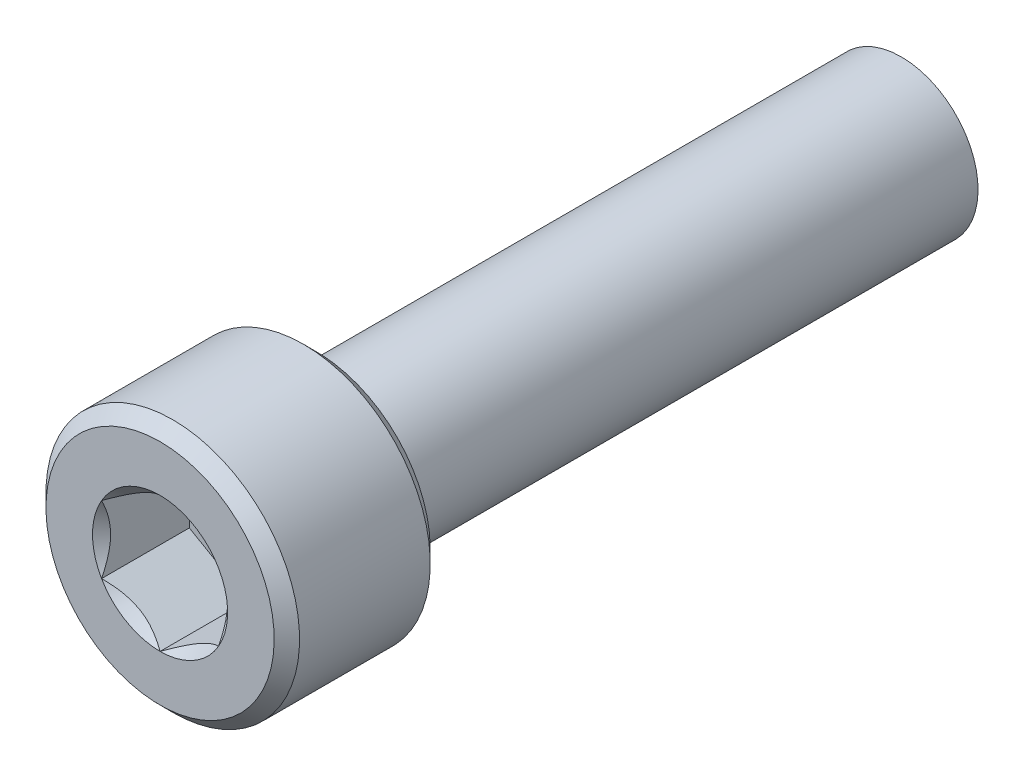
ISO-10303-21;
HEADER;
FILE_DESCRIPTION(('STEP AP214'),'2;1');
FILE_NAME('part.step','',(''),(''),'','','');
FILE_SCHEMA(('AUTOMOTIVE_DESIGN { 1 0 10303 214 1 1 1 1 }'));
ENDSEC;
DATA;
#1=APPLICATION_CONTEXT('core data for automotive mechanical design processes');
#2=APPLICATION_PROTOCOL_DEFINITION('international standard','automotive_design',2000,#1);
#3=PRODUCT_CONTEXT('',#1,'mechanical');
#4=PRODUCT('Part','Part','',(#3));
#5=PRODUCT_RELATED_PRODUCT_CATEGORY('part','',(#4));
#6=PRODUCT_DEFINITION_FORMATION('','',#4);
#7=PRODUCT_DEFINITION_CONTEXT('part definition',#1,'design');
#8=PRODUCT_DEFINITION('design','',#6,#7);
#9=PRODUCT_DEFINITION_SHAPE('','',#8);
#10=(LENGTH_UNIT() NAMED_UNIT(*) SI_UNIT(.MILLI.,.METRE.));
#11=(NAMED_UNIT(*) PLANE_ANGLE_UNIT() SI_UNIT($,.RADIAN.));
#12=(NAMED_UNIT(*) SI_UNIT($,.STERADIAN.) SOLID_ANGLE_UNIT());
#13=UNCERTAINTY_MEASURE_WITH_UNIT(LENGTH_MEASURE(1.E-05),#10,'distance_accuracy_value','');
#14=(GEOMETRIC_REPRESENTATION_CONTEXT(3) GLOBAL_UNCERTAINTY_ASSIGNED_CONTEXT((#13)) GLOBAL_UNIT_ASSIGNED_CONTEXT((#10,
#11,#12)) REPRESENTATION_CONTEXT('',''));
#15=CARTESIAN_POINT('',(0.,0.,0.));
#16=DIRECTION('',(0.,0.,1.));
#17=DIRECTION('',(1.,0.,0.));
#18=AXIS2_PLACEMENT_3D('',#15,#16,#17);
#19=CARTESIAN_POINT('',(3.,-5.19615242270663,3.5));
#20=DIRECTION('',(0.,0.,1.));
#21=DIRECTION('',(0.,-1.,0.));
#22=AXIS2_PLACEMENT_3D('',#19,#20,#21);
#23=PLANE('',#22);
#24=DIRECTION('',(-0.866025403784439,-0.5,0.));
#25=VECTOR('',#24,1.);
#26=CARTESIAN_POINT('',(0.,3.46410161513776,3.5));
#27=LINE('',#26,#25);
#28=CARTESIAN_POINT('',(0.,3.46410161513776,3.5));
#29=VERTEX_POINT('',#28);
#30=CARTESIAN_POINT('',(-3.,1.73205080756888,3.5));
#31=VERTEX_POINT('',#30);
#32=EDGE_CURVE('E82',#29,#31,#27,.T.);
#33=ORIENTED_EDGE('',*,*,#32,.T.);
#34=DIRECTION('',(0.,-1.,0.));
#35=VECTOR('',#34,1.);
#36=CARTESIAN_POINT('',(-3.,1.73205080756888,3.5));
#37=LINE('',#36,#35);
#38=CARTESIAN_POINT('',(-3.,-1.73205080756888,3.5));
#39=VERTEX_POINT('',#38);
#40=EDGE_CURVE('E84',#31,#39,#37,.T.);
#41=ORIENTED_EDGE('',*,*,#40,.T.);
#42=DIRECTION('',(0.866025403784439,-0.5,0.));
#43=VECTOR('',#42,1.);
#44=CARTESIAN_POINT('',(-3.,-1.73205080756888,3.5));
#45=LINE('',#44,#43);
#46=CARTESIAN_POINT('',(0.,-3.46410161513776,3.5));
#47=VERTEX_POINT('',#46);
#48=EDGE_CURVE('E85',#39,#47,#45,.T.);
#49=ORIENTED_EDGE('',*,*,#48,.T.);
#50=DIRECTION('',(0.866025403784439,0.5,0.));
#51=VECTOR('',#50,1.);
#52=CARTESIAN_POINT('',(0.,-3.46410161513776,3.5));
#53=LINE('',#52,#51);
#54=CARTESIAN_POINT('',(3.,-1.73205080756888,3.5));
#55=VERTEX_POINT('',#54);
#56=EDGE_CURVE('E71',#47,#55,#53,.T.);
#57=ORIENTED_EDGE('',*,*,#56,.T.);
#58=DIRECTION('',(0.,1.,0.));
#59=VECTOR('',#58,1.);
#60=CARTESIAN_POINT('',(3.,-1.73205080756888,3.5));
#61=LINE('',#60,#59);
#62=CARTESIAN_POINT('',(3.,1.73205080756888,3.5));
#63=VERTEX_POINT('',#62);
#64=EDGE_CURVE('E110',#55,#63,#61,.T.);
#65=ORIENTED_EDGE('',*,*,#64,.T.);
#66=DIRECTION('',(-0.866025403784439,0.5,0.));
#67=VECTOR('',#66,1.);
#68=CARTESIAN_POINT('',(3.,1.73205080756888,3.5));
#69=LINE('',#68,#67);
#70=EDGE_CURVE('E115',#63,#29,#69,.T.);
#71=ORIENTED_EDGE('',*,*,#70,.T.);
#72=EDGE_LOOP('',(#33,#41,#49,#57,#65,#71));
#73=FACE_BOUND('',#72,.T.);
#74=ADVANCED_FACE('F16',(#73),#23,.T.);
#75=CARTESIAN_POINT('',(-3.,-1.73205080756888,3.5));
#76=DIRECTION('',(-0.5,-0.866025403784439,0.));
#77=DIRECTION('',(0.866025403784439,-0.5,0.));
#78=AXIS2_PLACEMENT_3D('',#75,#76,#77);
#79=PLANE('',#78);
#80=CARTESIAN_POINT('',(-2.99999999999032,-1.7320508075832,8.00000000004136));
#81=CARTESIAN_POINT('',(-2.89688854158698,-1.79158223584331,7.9405256964109));
#82=CARTESIAN_POINT('',(-2.79205304728486,-1.85210903669697,7.88454499927976));
#83=CARTESIAN_POINT('',(-2.57828271602221,-1.97552939499453,7.78204673290586));
#84=CARTESIAN_POINT('',(-2.46932756060096,-2.03843468330721,7.73558617503093));
#85=CARTESIAN_POINT('',(-2.24962485444419,-2.16528009984896,7.65599891925579));
#86=CARTESIAN_POINT('',(-2.13893322488729,-2.2291879419705,7.62267223591901));
#87=CARTESIAN_POINT('',(-1.91511368639457,-2.35841021276905,7.57132616074406));
#88=CARTESIAN_POINT('',(-1.80199261010754,-2.42372069661444,7.55326845527869));
#89=CARTESIAN_POINT('',(-1.60702348021882,-2.53628617623938,7.53697523665388));
#90=CARTESIAN_POINT('',(-1.52542705975241,-2.58339589156056,7.53456399619299));
#91=CARTESIAN_POINT('',(-1.36236704805204,-2.67753863320983,7.53863151806395));
#92=CARTESIAN_POINT('',(-1.28090351339421,-2.72457162687367,7.545113396421));
#93=CARTESIAN_POINT('',(-1.11874833460044,-2.81819196300075,7.56659704587872));
#94=CARTESIAN_POINT('',(-1.03805765621663,-2.86477874788674,7.58160834263353));
#95=CARTESIAN_POINT('',(-0.878062170848356,-2.95715218443323,7.61933151354671));
#96=CARTESIAN_POINT('',(-0.798757258069119,-3.00293889717438,7.64204279713312));
#97=CARTESIAN_POINT('',(-0.657986748130276,-3.08421278898154,7.68876371422157));
#98=CARTESIAN_POINT('',(-0.596209197436678,-3.11988007450436,7.71154386359159));
#99=CARTESIAN_POINT('',(-0.473762853058809,-3.19057450439221,7.76077453974336));
#100=CARTESIAN_POINT('',(-0.413094092865233,-3.22560162942137,7.78722517718446));
#101=CARTESIAN_POINT('',(-0.293056496944738,-3.29490536773894,7.84320408348193));
#102=CARTESIAN_POINT('',(-0.233684247446644,-3.32918395196906,7.87272267287432));
#103=CARTESIAN_POINT('',(-0.116038978212991,-3.39710647983,7.93445005433357));
#104=CARTESIAN_POINT('',(-0.0577653112790005,-3.430750797121,7.96665719768312));
#105=CARTESIAN_POINT('',(-1.43648357031693E-11,-3.46410161512946,8.00000000004499));
#106=B_SPLINE_CURVE_WITH_KNOTS('',3,(#80,#81,#82,#83,#84,#85,#86,#87,#88,#89,#90,#91,#92,#93,
#94,#95,#96,#97,#98,#99,#100,#101,#102,#103,#104,#105),.UNSPECIFIED.,.F.,.F.,(4,2,2,2,2,2,2,2,2,
2,2,2,4),(0.,0.399548839738843,0.801424624392494,1.19691998043515,1.59141997109659,
1.87377108833457,2.15622116274835,2.43898729914404,2.7217317529063,2.94627735487685,
3.17082972801043,3.39469398393905,3.61842195284949),.UNSPECIFIED.);
#107=CARTESIAN_POINT('',(-2.99999999999255,-1.73205080756458,8.00000000004468));
#108=VERTEX_POINT('',#107);
#109=CARTESIAN_POINT('',(5.61843602158199E-12,-3.46410161512591,8.00000000004144));
#110=VERTEX_POINT('',#109);
#111=EDGE_CURVE('E19',#108,#110,#106,.T.);
#112=ORIENTED_EDGE('',*,*,#111,.T.);
#113=DIRECTION('',(0.,0.,1.));
#114=VECTOR('',#113,1.);
#115=CARTESIAN_POINT('',(0.,-3.46410161513776,3.5));
#116=LINE('',#115,#114);
#117=EDGE_CURVE('E90',#110,#47,#116,.F.);
#118=ORIENTED_EDGE('',*,*,#117,.T.);
#119=ORIENTED_EDGE('',*,*,#48,.F.);
#120=DIRECTION('',(0.,0.,1.));
#121=VECTOR('',#120,1.);
#122=CARTESIAN_POINT('',(-3.,-1.73205080756888,3.5));
#123=LINE('',#122,#121);
#124=EDGE_CURVE('E58',#39,#108,#123,.T.);
#125=ORIENTED_EDGE('',*,*,#124,.T.);
#126=EDGE_LOOP('',(#112,#118,#119,#125));
#127=FACE_BOUND('',#126,.T.);
#128=ADVANCED_FACE('F89',(#127),#79,.F.);
#129=CARTESIAN_POINT('',(-3.,1.73205080756888,3.5));
#130=DIRECTION('',(-1.,0.,0.));
#131=DIRECTION('',(0.,-1.,0.));
#132=AXIS2_PLACEMENT_3D('',#129,#130,#131);
#133=PLANE('',#132);
#134=CARTESIAN_POINT('',(-3.00000000000756,1.73205080755334,8.00000000004136));
#135=CARTESIAN_POINT('',(-3.00000000000272,1.61298795102473,7.9405256964109));
#136=CARTESIAN_POINT('',(-3.00000000000073,1.49193434931396,7.88454499927976));
#137=CARTESIAN_POINT('',(-2.99999999999927,1.24509363271631,7.78204673290586));
#138=CARTESIAN_POINT('',(-2.99999999999981,1.11928305609189,7.73558617503093));
#139=CARTESIAN_POINT('',(-3.00000000000019,0.86559222300906,7.65599891925579));
#140=CARTESIAN_POINT('',(-3.00000000000005,0.737776538765718,7.62267223591901));
#141=CARTESIAN_POINT('',(-2.99999999999995,0.479331997168439,7.57132616074405));
#142=CARTESIAN_POINT('',(-2.99999999999999,0.348711029477738,7.55326845527868));
#143=CARTESIAN_POINT('',(-3.00000000000001,0.123580070227885,7.53697523665387));
#144=CARTESIAN_POINT('',(-3.,0.0293606395855113,7.53456399619298));
#145=CARTESIAN_POINT('',(-3.,-0.158924843713037,7.53863151806394));
#146=CARTESIAN_POINT('',(-3.,-0.252990831040703,7.54511339642099));
#147=CARTESIAN_POINT('',(-3.,-0.440231503294856,7.56659704587872));
#148=CARTESIAN_POINT('',(-3.,-0.533405073066836,7.58160834263352));
#149=CARTESIAN_POINT('',(-3.,-0.718151946159826,7.61933151354671));
#150=CARTESIAN_POINT('',(-3.,-0.809725371642131,7.64204279713312));
#151=CARTESIAN_POINT('',(-3.,-0.972273155256436,7.68876371422157));
#152=CARTESIAN_POINT('',(-3.,-1.04360772630208,7.71154386359159));
#153=CARTESIAN_POINT('',(-3.,-1.18499658607778,7.76077453974336));
#154=CARTESIAN_POINT('',(-3.,-1.25505083613611,7.78722517718446));
#155=CARTESIAN_POINT('',(-3.,-1.39365831277125,7.84320408348193));
#156=CARTESIAN_POINT('',(-3.,-1.46221548123149,7.87272267287432));
#157=CARTESIAN_POINT('',(-3.,-1.59806053695336,7.93445005433357));
#158=CARTESIAN_POINT('',(-3.,-1.66534917153537,7.96665719768312));
#159=CARTESIAN_POINT('',(-3.,-1.73205080755229,8.00000000004499));
#160=B_SPLINE_CURVE_WITH_KNOTS('',3,(#134,#135,#136,#137,#138,#139,#140,#141,#142,#143,#144,
#145,#146,#147,#148,#149,#150,#151,#152,#153,#154,#155,#156,#157,#158,#159),.UNSPECIFIED.,.F.,
.F.,(4,2,2,2,2,2,2,2,2,2,2,2,4),(0.,0.399548839738845,0.801424624392497,1.19691998043516,
1.59141997109659,1.87377108833457,2.15622116274836,2.43898729914404,2.7217317529063,
2.94627735487685,3.17082972801044,3.39469398393906,3.6184219528495),.UNSPECIFIED.);
#161=CARTESIAN_POINT('',(-2.99999999999255,1.73205080756458,8.00000000004468));
#162=VERTEX_POINT('',#161);
#163=EDGE_CURVE('E94',#162,#108,#160,.T.);
#164=ORIENTED_EDGE('',*,*,#163,.T.);
#165=ORIENTED_EDGE('',*,*,#124,.F.);
#166=ORIENTED_EDGE('',*,*,#40,.F.);
#167=DIRECTION('',(0.,0.,1.));
#168=VECTOR('',#167,1.);
#169=CARTESIAN_POINT('',(-3.,1.73205080756888,3.5));
#170=LINE('',#169,#168);
#171=EDGE_CURVE('E96',#31,#162,#170,.T.);
#172=ORIENTED_EDGE('',*,*,#171,.T.);
#173=EDGE_LOOP('',(#164,#165,#166,#172));
#174=FACE_BOUND('',#173,.T.);
#175=ADVANCED_FACE('F92',(#174),#133,.F.);
#176=CARTESIAN_POINT('',(0.,3.46410161513776,3.5));
#177=DIRECTION('',(-0.5,0.866025403784439,0.));
#178=DIRECTION('',(-0.866025403784439,-0.5,0.));
#179=AXIS2_PLACEMENT_3D('',#176,#177,#178);
#180=PLANE('',#179);
#181=CARTESIAN_POINT('',(-1.72454109732172E-11,3.46410161513654,8.00000000004137));
#182=CARTESIAN_POINT('',(-0.103111458415738,3.40457018686804,7.9405256964109));
#183=CARTESIAN_POINT('',(-0.207946952715874,3.34404338601093,7.88454499927977));
#184=CARTESIAN_POINT('',(-0.42171728397706,3.22062302771084,7.78204673290587));
#185=CARTESIAN_POINT('',(-0.53067243939885,3.15771773939909,7.73558617503093));
#186=CARTESIAN_POINT('',(-0.750375145556008,3.03087232285802,7.6559989192558));
#187=CARTESIAN_POINT('',(-0.861066775112762,2.96696448073622,7.62267223591901));
#188=CARTESIAN_POINT('',(-1.08488631360538,2.8377422099375,7.57132616074406));
#189=CARTESIAN_POINT('',(-1.19800738989245,2.77243172609218,7.55326845527869));
#190=CARTESIAN_POINT('',(-1.39297651978119,2.65986624646727,7.53697523665388));
#191=CARTESIAN_POINT('',(-1.47457294024759,2.61275653114608,7.53456399619299));
#192=CARTESIAN_POINT('',(-1.63763295194796,2.5186137894968,7.53863151806395));
#193=CARTESIAN_POINT('',(-1.71909648660579,2.47158079583297,7.545113396421));
#194=CARTESIAN_POINT('',(-1.88125166539956,2.37796045970589,7.56659704587872));
#195=CARTESIAN_POINT('',(-1.96194234378338,2.3313736748199,7.58160834263353));
#196=CARTESIAN_POINT('',(-2.12193782915165,2.23900023827341,7.61933151354671));
#197=CARTESIAN_POINT('',(-2.20124274193088,2.19321352553226,7.64204279713312));
#198=CARTESIAN_POINT('',(-2.34201325186973,2.1119396337251,7.68876371422157));
#199=CARTESIAN_POINT('',(-2.40379080256332,2.07627234820228,7.7115438635916));
#200=CARTESIAN_POINT('',(-2.52623714694119,2.00557791831443,7.76077453974336));
#201=CARTESIAN_POINT('',(-2.58690590713477,1.97055079328527,7.78722517718446));
#202=CARTESIAN_POINT('',(-2.70694350305526,1.9012470549677,7.84320408348194));
#203=CARTESIAN_POINT('',(-2.76631575255336,1.86696847073758,7.87272267287432));
#204=CARTESIAN_POINT('',(-2.88396102178701,1.79904594287664,7.93445005433357));
#205=CARTESIAN_POINT('',(-2.942234688721,1.76540162558564,7.96665719768312));
#206=CARTESIAN_POINT('',(-2.99999999998564,1.73205080757718,8.00000000004499));
#207=B_SPLINE_CURVE_WITH_KNOTS('',3,(#181,#182,#183,#184,#185,#186,#187,#188,#189,#190,#191,
#192,#193,#194,#195,#196,#197,#198,#199,#200,#201,#202,#203,#204,#205,#206),.UNSPECIFIED.,.F.,
.F.,(4,2,2,2,2,2,2,2,2,2,2,2,4),(0.,0.399548839738842,0.801424624392494,1.19691998043515,
1.59141997109659,1.87377108833457,2.15622116274835,2.43898729914404,2.7217317529063,
2.94627735487685,3.17082972801043,3.39469398393906,3.61842195284949),.UNSPECIFIED.);
#208=CARTESIAN_POINT('',(0.,3.46410161512916,8.00000000004468));
#209=VERTEX_POINT('',#208);
#210=EDGE_CURVE('E197',#209,#162,#207,.T.);
#211=ORIENTED_EDGE('',*,*,#210,.T.);
#212=ORIENTED_EDGE('',*,*,#171,.F.);
#213=ORIENTED_EDGE('',*,*,#32,.F.);
#214=DIRECTION('',(0.,0.,1.));
#215=VECTOR('',#214,1.);
#216=CARTESIAN_POINT('',(0.,3.46410161513776,3.5));
#217=LINE('',#216,#215);
#218=EDGE_CURVE('E112',#29,#209,#217,.T.);
#219=ORIENTED_EDGE('',*,*,#218,.T.);
#220=EDGE_LOOP('',(#211,#212,#213,#219));
#221=FACE_BOUND('',#220,.T.);
#222=ADVANCED_FACE('F207',(#221),#180,.F.);
#223=CARTESIAN_POINT('',(3.,1.73205080756888,3.5));
#224=DIRECTION('',(0.5,0.866025403784439,0.));
#225=DIRECTION('',(-0.866025403784439,0.5,0.));
#226=AXIS2_PLACEMENT_3D('',#223,#224,#225);
#227=PLANE('',#226);
#228=CARTESIAN_POINT('',(2.99999999999032,1.7320508075832,8.00000000004136));
#229=CARTESIAN_POINT('',(2.89688854158699,1.79158223584331,7.9405256964109));
#230=CARTESIAN_POINT('',(2.79205304728486,1.85210903669697,7.88454499927976));
#231=CARTESIAN_POINT('',(2.57828271602221,1.97552939499453,7.78204673290586));
#232=CARTESIAN_POINT('',(2.46932756060096,2.03843468330721,7.73558617503093));
#233=CARTESIAN_POINT('',(2.24962485444419,2.16528009984896,7.65599891925579));
#234=CARTESIAN_POINT('',(2.13893322488729,2.2291879419705,7.62267223591901));
#235=CARTESIAN_POINT('',(1.91511368639457,2.35841021276906,7.57132616074406));
#236=CARTESIAN_POINT('',(1.80199261010754,2.42372069661444,7.55326845527869));
#237=CARTESIAN_POINT('',(1.60702348021882,2.53628617623938,7.53697523665388));
#238=CARTESIAN_POINT('',(1.52542705975241,2.58339589156056,7.53456399619299));
#239=CARTESIAN_POINT('',(1.36236704805204,2.67753863320983,7.53863151806395));
#240=CARTESIAN_POINT('',(1.28090351339422,2.72457162687367,7.545113396421));
#241=CARTESIAN_POINT('',(1.11874833460044,2.81819196300075,7.56659704587872));
#242=CARTESIAN_POINT('',(1.03805765621663,2.86477874788674,7.58160834263352));
#243=CARTESIAN_POINT('',(0.878062170848357,2.95715218443323,7.61933151354671));
#244=CARTESIAN_POINT('',(0.79875725806912,3.00293889717438,7.64204279713312));
#245=CARTESIAN_POINT('',(0.657986748130277,3.08421278898154,7.68876371422157));
#246=CARTESIAN_POINT('',(0.596209197436679,3.11988007450436,7.71154386359159));
#247=CARTESIAN_POINT('',(0.47376285305881,3.19057450439221,7.76077453974336));
#248=CARTESIAN_POINT('',(0.413094092865233,3.22560162942137,7.78722517718446));
#249=CARTESIAN_POINT('',(0.293056496944738,3.29490536773894,7.84320408348193));
#250=CARTESIAN_POINT('',(0.233684247446644,3.32918395196906,7.87272267287432));
#251=CARTESIAN_POINT('',(0.116038978212991,3.39710647983,7.93445005433357));
#252=CARTESIAN_POINT('',(0.0577653112790009,3.430750797121,7.96665719768312));
#253=CARTESIAN_POINT('',(1.43651801139567E-11,3.46410161512946,8.00000000004499));
#254=B_SPLINE_CURVE_WITH_KNOTS('',3,(#228,#229,#230,#231,#232,#233,#234,#235,#236,#237,#238,
#239,#240,#241,#242,#243,#244,#245,#246,#247,#248,#249,#250,#251,#252,#253),.UNSPECIFIED.,.F.,
.F.,(4,2,2,2,2,2,2,2,2,2,2,2,4),(0.,0.399548839738842,0.801424624392494,1.19691998043515,
1.59141997109659,1.87377108833457,2.15622116274835,2.43898729914404,2.7217317529063,
2.94627735487685,3.17082972801043,3.39469398393906,3.61842195284949),.UNSPECIFIED.);
#255=CARTESIAN_POINT('',(2.99999999999255,1.73205080756458,8.00000000004468));
#256=VERTEX_POINT('',#255);
#257=EDGE_CURVE('E189',#256,#209,#254,.T.);
#258=ORIENTED_EDGE('',*,*,#257,.T.);
#259=ORIENTED_EDGE('',*,*,#218,.F.);
#260=ORIENTED_EDGE('',*,*,#70,.F.);
#261=DIRECTION('',(0.,0.,-1.));
#262=VECTOR('',#261,1.);
#263=CARTESIAN_POINT('',(3.,1.73205080756888,3.5));
#264=LINE('',#263,#262);
#265=EDGE_CURVE('E107',#63,#256,#264,.F.);
#266=ORIENTED_EDGE('',*,*,#265,.T.);
#267=EDGE_LOOP('',(#258,#259,#260,#266));
#268=FACE_BOUND('',#267,.T.);
#269=ADVANCED_FACE('F203',(#268),#227,.F.);
#270=CARTESIAN_POINT('',(3.,-1.73205080756888,3.5));
#271=DIRECTION('',(1.,0.,0.));
#272=DIRECTION('',(0.,0.,-1.));
#273=AXIS2_PLACEMENT_3D('',#270,#271,#272);
#274=PLANE('',#273);
#275=CARTESIAN_POINT('',(3.00000000000756,-1.73205080755334,8.00000000004136));
#276=CARTESIAN_POINT('',(3.00000000000272,-1.61298795102473,7.9405256964109));
#277=CARTESIAN_POINT('',(3.00000000000073,-1.49193434931396,7.88454499927976));
#278=CARTESIAN_POINT('',(2.99999999999927,-1.24509363271631,7.78204673290586));
#279=CARTESIAN_POINT('',(2.99999999999981,-1.11928305609189,7.73558617503093));
#280=CARTESIAN_POINT('',(3.00000000000019,-0.86559222300906,7.65599891925579));
#281=CARTESIAN_POINT('',(3.00000000000005,-0.737776538765717,7.62267223591901));
#282=CARTESIAN_POINT('',(2.99999999999995,-0.479331997168439,7.57132616074405));
#283=CARTESIAN_POINT('',(2.99999999999999,-0.348711029477738,7.55326845527868));
#284=CARTESIAN_POINT('',(3.00000000000001,-0.123580070227885,7.53697523665387));
#285=CARTESIAN_POINT('',(3.,-0.0293606395855116,7.53456399619299));
#286=CARTESIAN_POINT('',(3.,0.158924843713037,7.53863151806395));
#287=CARTESIAN_POINT('',(3.,0.252990831040703,7.54511339642099));
#288=CARTESIAN_POINT('',(3.,0.440231503294856,7.56659704587872));
#289=CARTESIAN_POINT('',(3.,0.533405073066836,7.58160834263352));
#290=CARTESIAN_POINT('',(3.,0.718151946159826,7.61933151354671));
#291=CARTESIAN_POINT('',(3.,0.80972537164213,7.64204279713312));
#292=CARTESIAN_POINT('',(3.,0.972273155256435,7.68876371422157));
#293=CARTESIAN_POINT('',(3.,1.04360772630208,7.71154386359159));
#294=CARTESIAN_POINT('',(3.,1.18499658607778,7.76077453974336));
#295=CARTESIAN_POINT('',(3.,1.25505083613611,7.78722517718446));
#296=CARTESIAN_POINT('',(3.,1.39365831277125,7.84320408348193));
#297=CARTESIAN_POINT('',(3.,1.46221548123149,7.87272267287432));
#298=CARTESIAN_POINT('',(3.,1.59806053695336,7.93445005433357));
#299=CARTESIAN_POINT('',(3.,1.66534917153537,7.96665719768312));
#300=CARTESIAN_POINT('',(3.,1.73205080755229,8.00000000004499));
#301=B_SPLINE_CURVE_WITH_KNOTS('',3,(#275,#276,#277,#278,#279,#280,#281,#282,#283,#284,#285,
#286,#287,#288,#289,#290,#291,#292,#293,#294,#295,#296,#297,#298,#299,#300),.UNSPECIFIED.,.F.,
.F.,(4,2,2,2,2,2,2,2,2,2,2,2,4),(0.,0.399548839738844,0.801424624392497,1.19691998043516,
1.59141997109659,1.87377108833457,2.15622116274836,2.43898729914404,2.7217317529063,
2.94627735487685,3.17082972801044,3.39469398393906,3.6184219528495),.UNSPECIFIED.);
#302=CARTESIAN_POINT('',(2.99999999999255,-1.73205080756458,8.00000000004468));
#303=VERTEX_POINT('',#302);
#304=EDGE_CURVE('E159',#303,#256,#301,.T.);
#305=ORIENTED_EDGE('',*,*,#304,.T.);
#306=ORIENTED_EDGE('',*,*,#265,.F.);
#307=ORIENTED_EDGE('',*,*,#64,.F.);
#308=DIRECTION('',(0.,0.,1.));
#309=VECTOR('',#308,1.);
#310=CARTESIAN_POINT('',(3.,-1.73205080756888,3.5));
#311=LINE('',#310,#309);
#312=EDGE_CURVE('E39',#55,#303,#311,.T.);
#313=ORIENTED_EDGE('',*,*,#312,.T.);
#314=EDGE_LOOP('',(#305,#306,#307,#313));
#315=FACE_BOUND('',#314,.T.);
#316=ADVANCED_FACE('F206',(#315),#274,.F.);
#317=CARTESIAN_POINT('',(0.,-3.46410161513776,3.5));
#318=DIRECTION('',(0.5,-0.866025403784439,0.));
#319=DIRECTION('',(0.866025403784439,0.5,0.));
#320=AXIS2_PLACEMENT_3D('',#317,#318,#319);
#321=PLANE('',#320);
#322=CARTESIAN_POINT('',(1.72473274328695E-11,-3.46410161513653,8.00000000004137));
#323=CARTESIAN_POINT('',(0.10311145841574,-3.40457018686804,7.9405256964109));
#324=CARTESIAN_POINT('',(0.207946952715876,-3.34404338601093,7.88454499927977));
#325=CARTESIAN_POINT('',(0.421717283977062,-3.22062302771084,7.78204673290587));
#326=CARTESIAN_POINT('',(0.530672439398852,-3.15771773939909,7.73558617503094));
#327=CARTESIAN_POINT('',(0.75037514555601,-3.03087232285802,7.6559989192558));
#328=CARTESIAN_POINT('',(0.861066775112763,-2.96696448073622,7.62267223591901));
#329=CARTESIAN_POINT('',(1.08488631360538,-2.8377422099375,7.57132616074406));
#330=CARTESIAN_POINT('',(1.19800738989245,-2.77243172609218,7.55326845527869));
#331=CARTESIAN_POINT('',(1.39297651978119,-2.65986624646727,7.53697523665388));
#332=CARTESIAN_POINT('',(1.47457294024759,-2.61275653114608,7.53456399619299));
#333=CARTESIAN_POINT('',(1.63763295194796,-2.5186137894968,7.53863151806395));
#334=CARTESIAN_POINT('',(1.71909648660579,-2.47158079583297,7.545113396421));
#335=CARTESIAN_POINT('',(1.88125166539956,-2.37796045970589,7.56659704587873));
#336=CARTESIAN_POINT('',(1.96194234378338,-2.3313736748199,7.58160834263353));
#337=CARTESIAN_POINT('',(2.12193782915165,-2.23900023827341,7.61933151354671));
#338=CARTESIAN_POINT('',(2.20124274193088,-2.19321352553225,7.64204279713312));
#339=CARTESIAN_POINT('',(2.34201325186973,-2.1119396337251,7.68876371422157));
#340=CARTESIAN_POINT('',(2.40379080256333,-2.07627234820228,7.7115438635916));
#341=CARTESIAN_POINT('',(2.52623714694119,-2.00557791831443,7.76077453974336));
#342=CARTESIAN_POINT('',(2.58690590713477,-1.97055079328527,7.78722517718447));
#343=CARTESIAN_POINT('',(2.70694350305526,-1.9012470549677,7.84320408348194));
#344=CARTESIAN_POINT('',(2.76631575255336,-1.86696847073758,7.87272267287432));
#345=CARTESIAN_POINT('',(2.88396102178701,-1.79904594287664,7.93445005433357));
#346=CARTESIAN_POINT('',(2.942234688721,-1.76540162558564,7.96665719768313));
#347=CARTESIAN_POINT('',(2.99999999998563,-1.73205080757718,8.00000000004499));
#348=B_SPLINE_CURVE_WITH_KNOTS('',3,(#322,#323,#324,#325,#326,#327,#328,#329,#330,#331,#332,
#333,#334,#335,#336,#337,#338,#339,#340,#341,#342,#343,#344,#345,#346,#347),.UNSPECIFIED.,.F.,
.F.,(4,2,2,2,2,2,2,2,2,2,2,2,4),(0.,0.399548839738842,0.801424624392493,1.19691998043515,
1.59141997109658,1.87377108833456,2.15622116274835,2.43898729914404,2.7217317529063,
2.94627735487685,3.17082972801043,3.39469398393905,3.61842195284948),.UNSPECIFIED.);
#349=EDGE_CURVE('E151',#110,#303,#348,.T.);
#350=ORIENTED_EDGE('',*,*,#349,.T.);
#351=ORIENTED_EDGE('',*,*,#312,.F.);
#352=ORIENTED_EDGE('',*,*,#56,.F.);
#353=ORIENTED_EDGE('',*,*,#117,.F.);
#354=EDGE_LOOP('',(#350,#351,#352,#353));
#355=FACE_BOUND('',#354,.T.);
#356=ADVANCED_FACE('F167',(#355),#321,.F.);
#357=CARTESIAN_POINT('',(0.,0.,7.99999999998136));
#358=DIRECTION('',(0.,0.,1.));
#359=DIRECTION('',(1.,0.,0.));
#360=AXIS2_PLACEMENT_3D('',#357,#358,#359);
#361=CONICAL_SURFACE('',#360,3.46410161506583,0.785398163397448);
#362=ORIENTED_EDGE('',*,*,#111,.F.);
#363=CARTESIAN_POINT('',(0.,0.,8.0000000000382));
#364=DIRECTION('',(0.,0.,1.));
#365=DIRECTION('',(1.,0.,0.));
#366=AXIS2_PLACEMENT_3D('',#363,#364,#365);
#367=CIRCLE('',#366,3.46410161512267);
#368=EDGE_CURVE('E148',#110,#108,#367,.F.);
#369=ORIENTED_EDGE('',*,*,#368,.F.);
#370=EDGE_LOOP('',(#362,#369));
#371=FACE_BOUND('',#370,.T.);
#372=ADVANCED_FACE('F224',(#371),#361,.F.);
#373=CARTESIAN_POINT('',(0.,0.,7.99999999998136));
#374=DIRECTION('',(0.,0.,1.));
#375=DIRECTION('',(1.,0.,0.));
#376=AXIS2_PLACEMENT_3D('',#373,#374,#375);
#377=CONICAL_SURFACE('',#376,3.46410161506583,0.785398163397448);
#378=CARTESIAN_POINT('',(0.,0.,8.0000000000382));
#379=DIRECTION('',(0.,0.,1.));
#380=DIRECTION('',(1.,0.,0.));
#381=AXIS2_PLACEMENT_3D('',#378,#379,#380);
#382=CIRCLE('',#381,3.46410161512267);
#383=EDGE_CURVE('E145',#108,#162,#382,.F.);
#384=ORIENTED_EDGE('',*,*,#383,.F.);
#385=ORIENTED_EDGE('',*,*,#163,.F.);
#386=EDGE_LOOP('',(#384,#385));
#387=FACE_BOUND('',#386,.T.);
#388=ADVANCED_FACE('F221',(#387),#377,.F.);
#389=CARTESIAN_POINT('',(0.,0.,7.99999999998136));
#390=DIRECTION('',(0.,0.,1.));
#391=DIRECTION('',(1.,0.,0.));
#392=AXIS2_PLACEMENT_3D('',#389,#390,#391);
#393=CONICAL_SURFACE('',#392,3.46410161506583,0.785398163397448);
#394=ORIENTED_EDGE('',*,*,#210,.F.);
#395=CARTESIAN_POINT('',(0.,0.,8.0000000000382));
#396=DIRECTION('',(0.,0.,1.));
#397=DIRECTION('',(1.,0.,0.));
#398=AXIS2_PLACEMENT_3D('',#395,#396,#397);
#399=CIRCLE('',#398,3.46410161512267);
#400=EDGE_CURVE('E142',#162,#209,#399,.F.);
#401=ORIENTED_EDGE('',*,*,#400,.F.);
#402=EDGE_LOOP('',(#394,#401));
#403=FACE_BOUND('',#402,.T.);
#404=ADVANCED_FACE('F185',(#403),#393,.F.);
#405=CARTESIAN_POINT('',(0.,0.,7.99999999998136));
#406=DIRECTION('',(0.,0.,1.));
#407=DIRECTION('',(1.,0.,0.));
#408=AXIS2_PLACEMENT_3D('',#405,#406,#407);
#409=CONICAL_SURFACE('',#408,3.46410161506583,0.785398163397448);
#410=ORIENTED_EDGE('',*,*,#257,.F.);
#411=CARTESIAN_POINT('',(0.,0.,8.0000000000382));
#412=DIRECTION('',(0.,0.,1.));
#413=DIRECTION('',(1.,0.,0.));
#414=AXIS2_PLACEMENT_3D('',#411,#412,#413);
#415=CIRCLE('',#414,3.46410161512267);
#416=EDGE_CURVE('E139',#209,#256,#415,.F.);
#417=ORIENTED_EDGE('',*,*,#416,.F.);
#418=EDGE_LOOP('',(#410,#417));
#419=FACE_BOUND('',#418,.T.);
#420=ADVANCED_FACE('F180',(#419),#409,.F.);
#421=CARTESIAN_POINT('',(0.,0.,7.99999999998136));
#422=DIRECTION('',(0.,0.,1.));
#423=DIRECTION('',(1.,0.,0.));
#424=AXIS2_PLACEMENT_3D('',#421,#422,#423);
#425=CONICAL_SURFACE('',#424,3.46410161506583,0.785398163397448);
#426=ORIENTED_EDGE('',*,*,#304,.F.);
#427=CARTESIAN_POINT('',(0.,0.,8.0000000000382));
#428=DIRECTION('',(0.,0.,1.));
#429=DIRECTION('',(1.,0.,0.));
#430=AXIS2_PLACEMENT_3D('',#427,#428,#429);
#431=CIRCLE('',#430,3.46410161512267);
#432=EDGE_CURVE('E136',#256,#303,#431,.F.);
#433=ORIENTED_EDGE('',*,*,#432,.F.);
#434=EDGE_LOOP('',(#426,#433));
#435=FACE_BOUND('',#434,.T.);
#436=ADVANCED_FACE('F174',(#435),#425,.F.);
#437=CARTESIAN_POINT('',(0.,0.,7.99999999998136));
#438=DIRECTION('',(0.,0.,1.));
#439=DIRECTION('',(1.,0.,0.));
#440=AXIS2_PLACEMENT_3D('',#437,#438,#439);
#441=CONICAL_SURFACE('',#440,3.46410161506583,0.785398163397448);
#442=ORIENTED_EDGE('',*,*,#349,.F.);
#443=CARTESIAN_POINT('',(0.,0.,8.0000000000382));
#444=DIRECTION('',(0.,0.,1.));
#445=DIRECTION('',(1.,0.,0.));
#446=AXIS2_PLACEMENT_3D('',#443,#444,#445);
#447=CIRCLE('',#446,3.46410161512267);
#448=EDGE_CURVE('E133',#303,#110,#447,.F.);
#449=ORIENTED_EDGE('',*,*,#448,.F.);
#450=EDGE_LOOP('',(#442,#449));
#451=FACE_BOUND('',#450,.T.);
#452=ADVANCED_FACE('F169',(#451),#441,.F.);
#453=CARTESIAN_POINT('',(0.,0.,8.));
#454=DIRECTION('',(0.,0.,1.));
#455=DIRECTION('',(0.,-1.,0.));
#456=AXIS2_PLACEMENT_3D('',#453,#454,#455);
#457=PLANE('',#456);
#458=ORIENTED_EDGE('',*,*,#432,.T.);
#459=ORIENTED_EDGE('',*,*,#448,.T.);
#460=ORIENTED_EDGE('',*,*,#368,.T.);
#461=ORIENTED_EDGE('',*,*,#383,.T.);
#462=ORIENTED_EDGE('',*,*,#400,.T.);
#463=ORIENTED_EDGE('',*,*,#416,.T.);
#464=EDGE_LOOP('',(#458,#459,#460,#461,#462,#463));
#465=FACE_BOUND('',#464,.T.);
#466=CARTESIAN_POINT('',(0.,0.,7.99999999998136));
#467=DIRECTION('',(0.,0.,-1.));
#468=DIRECTION('',(0.,1.,0.));
#469=AXIS2_PLACEMENT_3D('',#466,#467,#468);
#470=CIRCLE('',#469,5.8500000000663);
#471=CARTESIAN_POINT('',(0.,5.8500000000663,7.99999999998136));
#472=VERTEX_POINT('',#471);
#473=EDGE_CURVE('E129',#472,#472,#470,.T.);
#474=ORIENTED_EDGE('',*,*,#473,.F.);
#475=EDGE_LOOP('',(#474));
#476=FACE_BOUND('',#475,.T.);
#477=ADVANCED_FACE('F173',(#465,#476),#457,.T.);
#478=CARTESIAN_POINT('',(0.,0.,7.35000000003083));
#479=DIRECTION('',(0.,0.,-1.));
#480=DIRECTION('',(0.,1.,0.));
#481=AXIS2_PLACEMENT_3D('',#478,#479,#480);
#482=CONICAL_SURFACE('',#481,6.50000000001683,0.785398163397448);
#483=ORIENTED_EDGE('',*,*,#473,.T.);
#484=EDGE_LOOP('',(#483));
#485=FACE_BOUND('',#484,.T.);
#486=CARTESIAN_POINT('',(0.,0.,7.34999999999999));
#487=DIRECTION('',(0.,0.,-1.));
#488=DIRECTION('',(0.,1.,0.));
#489=AXIS2_PLACEMENT_3D('',#486,#487,#488);
#490=CIRCLE('',#489,6.5);
#491=CARTESIAN_POINT('',(0.,6.5,7.34999999999999));
#492=VERTEX_POINT('',#491);
#493=EDGE_CURVE('E132',#492,#492,#490,.T.);
#494=ORIENTED_EDGE('',*,*,#493,.F.);
#495=EDGE_LOOP('',(#494));
#496=FACE_BOUND('',#495,.T.);
#497=ADVANCED_FACE('F256',(#485,#496),#482,.T.);
#498=CARTESIAN_POINT('',(0.,0.,8.));
#499=DIRECTION('',(0.,0.,-1.));
#500=DIRECTION('',(0.,1.,0.));
#501=AXIS2_PLACEMENT_3D('',#498,#499,#500);
#502=CYLINDRICAL_SURFACE('',#501,6.5);
#503=ORIENTED_EDGE('',*,*,#493,.T.);
#504=EDGE_LOOP('',(#503));
#505=FACE_BOUND('',#504,.T.);
#506=CARTESIAN_POINT('',(0.,0.,0.650000000007367));
#507=DIRECTION('',(0.,0.,1.));
#508=DIRECTION('',(-1.,0.,0.));
#509=AXIS2_PLACEMENT_3D('',#506,#507,#508);
#510=CIRCLE('',#509,6.50000000001683);
#511=CARTESIAN_POINT('',(-6.50000000001682,0.,0.650000000007367));
#512=VERTEX_POINT('',#511);
#513=EDGE_CURVE('E128',#512,#512,#510,.F.);
#514=ORIENTED_EDGE('',*,*,#513,.F.);
#515=EDGE_LOOP('',(#514));
#516=FACE_BOUND('',#515,.T.);
#517=ADVANCED_FACE('F253',(#505,#516),#502,.T.);
#518=CARTESIAN_POINT('',(0.,0.,0.650000000007367));
#519=DIRECTION('',(0.,0.,1.));
#520=DIRECTION('',(0.,-1.,0.));
#521=AXIS2_PLACEMENT_3D('',#518,#519,#520);
#522=CONICAL_SURFACE('',#521,6.50000000001683,0.785398163397448);
#523=CARTESIAN_POINT('',(0.,0.,5.6843418860808E-11));
#524=DIRECTION('',(0.,0.,1.));
#525=DIRECTION('',(0.,-1.,0.));
#526=AXIS2_PLACEMENT_3D('',#523,#524,#525);
#527=CIRCLE('',#526,5.8500000000663);
#528=CARTESIAN_POINT('',(0.,-5.8500000000663,5.68441506972745E-11));
#529=VERTEX_POINT('',#528);
#530=EDGE_CURVE('E125',#529,#529,#527,.T.);
#531=ORIENTED_EDGE('',*,*,#530,.T.);
#532=EDGE_LOOP('',(#531));
#533=FACE_BOUND('',#532,.T.);
#534=ORIENTED_EDGE('',*,*,#513,.T.);
#535=EDGE_LOOP('',(#534));
#536=FACE_BOUND('',#535,.T.);
#537=ADVANCED_FACE('F249',(#533,#536),#522,.T.);
#538=CARTESIAN_POINT('',(0.,0.,-30.));
#539=DIRECTION('',(0.,0.,-1.));
#540=DIRECTION('',(0.,1.,0.));
#541=AXIS2_PLACEMENT_3D('',#538,#539,#540);
#542=PLANE('',#541);
#543=CARTESIAN_POINT('',(0.,0.,-30.));
#544=DIRECTION('',(0.,0.,-1.));
#545=DIRECTION('',(0.,1.,0.));
#546=AXIS2_PLACEMENT_3D('',#543,#544,#545);
#547=CIRCLE('',#546,3.933);
#548=CARTESIAN_POINT('',(0.,3.933,-30.));
#549=VERTEX_POINT('',#548);
#550=EDGE_CURVE('E30',#549,#549,#547,.F.);
#551=ORIENTED_EDGE('',*,*,#550,.F.);
#552=EDGE_LOOP('',(#551));
#553=FACE_BOUND('',#552,.T.);
#554=ADVANCED_FACE('F242',(#553),#542,.T.);
#555=CARTESIAN_POINT('',(0.,0.,0.));
#556=DIRECTION('',(0.,0.,1.));
#557=DIRECTION('',(0.,-1.,0.));
#558=AXIS2_PLACEMENT_3D('',#555,#556,#557);
#559=PLANE('',#558);
#560=CARTESIAN_POINT('',(0.,0.,0.));
#561=DIRECTION('',(0.,0.,-1.));
#562=DIRECTION('',(0.,1.,0.));
#563=AXIS2_PLACEMENT_3D('',#560,#561,#562);
#564=CIRCLE('',#563,3.933);
#565=CARTESIAN_POINT('',(0.,3.933,0.));
#566=VERTEX_POINT('',#565);
#567=EDGE_CURVE('E11',#566,#566,#564,.T.);
#568=ORIENTED_EDGE('',*,*,#567,.F.);
#569=EDGE_LOOP('',(#568));
#570=FACE_BOUND('',#569,.T.);
#571=ORIENTED_EDGE('',*,*,#530,.F.);
#572=EDGE_LOOP('',(#571));
#573=FACE_BOUND('',#572,.T.);
#574=ADVANCED_FACE('F236',(#570,#573),#559,.F.);
#575=CARTESIAN_POINT('',(0.,0.,0.));
#576=DIRECTION('',(0.,0.,-1.));
#577=DIRECTION('',(0.,1.,0.));
#578=AXIS2_PLACEMENT_3D('',#575,#576,#577);
#579=CYLINDRICAL_SURFACE('',#578,3.933);
#580=ORIENTED_EDGE('',*,*,#567,.T.);
#581=EDGE_LOOP('',(#580));
#582=FACE_BOUND('',#581,.T.);
#583=ORIENTED_EDGE('',*,*,#550,.T.);
#584=EDGE_LOOP('',(#583));
#585=FACE_BOUND('',#584,.T.);
#586=ADVANCED_FACE('F234',(#582,#585),#579,.T.);
#587=CLOSED_SHELL('',(#74,#128,#175,#222,#269,#316,#356,#372,#388,#404,#420,#436,#452,#477,#497,
#517,#537,#554,#574,#586));
#588=MANIFOLD_SOLID_BREP('B1',#587);
#589=ADVANCED_BREP_SHAPE_REPRESENTATION('',(#18,#588),#14);
#590=SHAPE_DEFINITION_REPRESENTATION(#9,#589);
ENDSEC;
END-ISO-10303-21;
